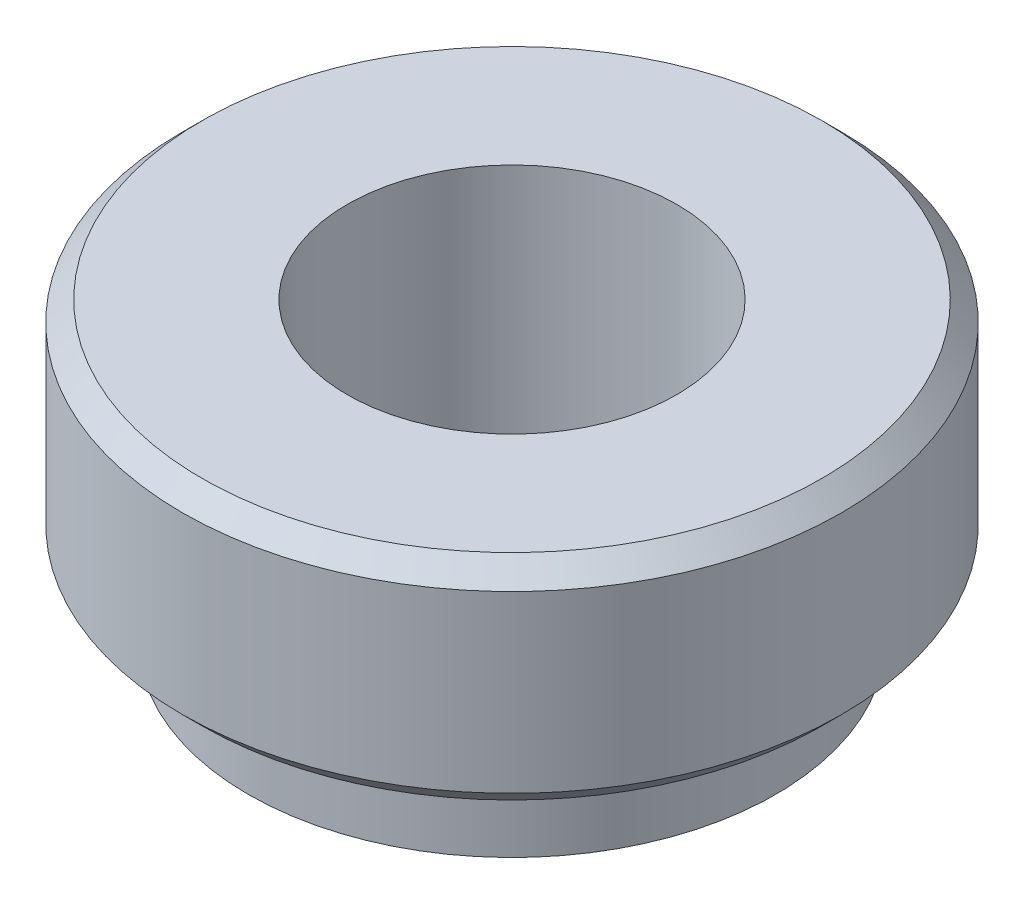
ISO-10303-21;
HEADER;
FILE_DESCRIPTION(('STEP AP214'),'2;1');
FILE_NAME('part.step','',(''),(''),'','','');
FILE_SCHEMA(('AUTOMOTIVE_DESIGN { 1 0 10303 214 1 1 1 1 }'));
ENDSEC;
DATA;
#1=APPLICATION_CONTEXT('core data for automotive mechanical design processes');
#2=APPLICATION_PROTOCOL_DEFINITION('international standard','automotive_design',2000,#1);
#3=PRODUCT_CONTEXT('',#1,'mechanical');
#4=PRODUCT('Part','Part','',(#3));
#5=PRODUCT_RELATED_PRODUCT_CATEGORY('part','',(#4));
#6=PRODUCT_DEFINITION_FORMATION('','',#4);
#7=PRODUCT_DEFINITION_CONTEXT('part definition',#1,'design');
#8=PRODUCT_DEFINITION('design','',#6,#7);
#9=PRODUCT_DEFINITION_SHAPE('','',#8);
#10=(LENGTH_UNIT() NAMED_UNIT(*) SI_UNIT(.MILLI.,.METRE.));
#11=(NAMED_UNIT(*) PLANE_ANGLE_UNIT() SI_UNIT($,.RADIAN.));
#12=(NAMED_UNIT(*) SI_UNIT($,.STERADIAN.) SOLID_ANGLE_UNIT());
#13=UNCERTAINTY_MEASURE_WITH_UNIT(LENGTH_MEASURE(1.E-05),#10,'distance_accuracy_value','');
#14=(GEOMETRIC_REPRESENTATION_CONTEXT(3) GLOBAL_UNCERTAINTY_ASSIGNED_CONTEXT((#13)) GLOBAL_UNIT_ASSIGNED_CONTEXT((#10,
#11,#12)) REPRESENTATION_CONTEXT('',''));
#15=CARTESIAN_POINT('',(0.,0.,0.));
#16=DIRECTION('',(0.,0.,1.));
#17=DIRECTION('',(1.,0.,0.));
#18=AXIS2_PLACEMENT_3D('',#15,#16,#17);
#19=CARTESIAN_POINT('',(-4.00000000000002,0.,0.));
#20=DIRECTION('',(0.,0.999999999999999,0.));
#21=DIRECTION('',(0.,0.,1.));
#22=AXIS2_PLACEMENT_3D('',#19,#20,#21);
#23=PLANE('',#22);
#24=CARTESIAN_POINT('',(0.,0.,0.));
#25=DIRECTION('',(0.,-0.999999999999999,0.));
#26=DIRECTION('',(0.,0.,-1.));
#27=AXIS2_PLACEMENT_3D('',#24,#25,#26);
#28=CIRCLE('',#27,2.5);
#29=CARTESIAN_POINT('',(0.,0.,-2.5));
#30=VERTEX_POINT('',#29);
#31=EDGE_CURVE('E46',#30,#30,#28,.T.);
#32=ORIENTED_EDGE('',*,*,#31,.F.);
#33=EDGE_LOOP('',(#32));
#34=FACE_BOUND('',#33,.T.);
#35=CARTESIAN_POINT('',(0.,0.,0.));
#36=DIRECTION('',(0.,-0.999999999999999,0.));
#37=DIRECTION('',(0.,0.,-1.));
#38=AXIS2_PLACEMENT_3D('',#35,#36,#37);
#39=CIRCLE('',#38,4.);
#40=CARTESIAN_POINT('',(0.,0.,-4.));
#41=VERTEX_POINT('',#40);
#42=EDGE_CURVE('E55',#41,#41,#39,.T.);
#43=ORIENTED_EDGE('',*,*,#42,.T.);
#44=EDGE_LOOP('',(#43));
#45=FACE_BOUND('',#44,.T.);
#46=ADVANCED_FACE('F27',(#34,#45),#23,.F.);
#47=CARTESIAN_POINT('',(0.,0.,0.));
#48=DIRECTION('',(0.,-0.999999999999999,0.));
#49=DIRECTION('',(0.,0.,-1.));
#50=AXIS2_PLACEMENT_3D('',#47,#48,#49);
#51=CYLINDRICAL_SURFACE('',#50,2.5);
#52=CARTESIAN_POINT('',(0.,4.49999999999984,0.));
#53=DIRECTION('',(0.,-0.999999999999999,0.));
#54=DIRECTION('',(0.,0.,-1.));
#55=AXIS2_PLACEMENT_3D('',#52,#53,#54);
#56=CIRCLE('',#55,2.5);
#57=CARTESIAN_POINT('',(0.,4.49999999999984,-2.49999999999998));
#58=VERTEX_POINT('',#57);
#59=EDGE_CURVE('E49',#58,#58,#56,.T.);
#60=ORIENTED_EDGE('',*,*,#59,.F.);
#61=EDGE_LOOP('',(#60));
#62=FACE_BOUND('',#61,.T.);
#63=ORIENTED_EDGE('',*,*,#31,.T.);
#64=EDGE_LOOP('',(#63));
#65=FACE_BOUND('',#64,.T.);
#66=ADVANCED_FACE('F78',(#62,#65),#51,.F.);
#67=CARTESIAN_POINT('',(-2.49999999999999,4.49999999999978,0.));
#68=DIRECTION('',(0.,-0.999999999999999,0.));
#69=DIRECTION('',(0.,0.,-1.));
#70=AXIS2_PLACEMENT_3D('',#67,#68,#69);
#71=PLANE('',#70);
#72=CARTESIAN_POINT('',(0.,4.49999999999984,0.));
#73=DIRECTION('',(0.,-0.999999999999999,0.));
#74=DIRECTION('',(0.,0.,-1.));
#75=AXIS2_PLACEMENT_3D('',#72,#73,#74);
#76=CIRCLE('',#75,4.7);
#77=CARTESIAN_POINT('',(0.,4.49999999999984,-4.69999999999999));
#78=VERTEX_POINT('',#77);
#79=EDGE_CURVE('E10',#78,#78,#76,.F.);
#80=ORIENTED_EDGE('',*,*,#79,.T.);
#81=EDGE_LOOP('',(#80));
#82=FACE_BOUND('',#81,.T.);
#83=ORIENTED_EDGE('',*,*,#59,.T.);
#84=EDGE_LOOP('',(#83));
#85=FACE_BOUND('',#84,.T.);
#86=ADVANCED_FACE('F75',(#82,#85),#71,.F.);
#87=CARTESIAN_POINT('',(0.,0.,0.));
#88=DIRECTION('',(0.,-0.999999999999999,0.));
#89=DIRECTION('',(0.,0.,-1.));
#90=AXIS2_PLACEMENT_3D('',#87,#88,#89);
#91=CYLINDRICAL_SURFACE('',#90,5.);
#92=CARTESIAN_POINT('',(0.,1.55000000000011,0.));
#93=DIRECTION('',(0.,0.999999999999999,0.));
#94=DIRECTION('',(0.,0.,1.));
#95=AXIS2_PLACEMENT_3D('',#92,#93,#94);
#96=CIRCLE('',#95,5.);
#97=CARTESIAN_POINT('',(0.,1.55000000000011,5.00000000000002));
#98=VERTEX_POINT('',#97);
#99=EDGE_CURVE('E33',#98,#98,#96,.T.);
#100=ORIENTED_EDGE('',*,*,#99,.T.);
#101=EDGE_LOOP('',(#100));
#102=FACE_BOUND('',#101,.T.);
#103=CARTESIAN_POINT('',(0.,4.19999999999987,0.));
#104=DIRECTION('',(0.,-0.999999999999999,0.));
#105=DIRECTION('',(0.,0.,-1.));
#106=AXIS2_PLACEMENT_3D('',#103,#104,#105);
#107=CIRCLE('',#106,5.);
#108=CARTESIAN_POINT('',(0.,4.19999999999987,-4.99999999999999));
#109=VERTEX_POINT('',#108);
#110=EDGE_CURVE('E37',#109,#109,#107,.T.);
#111=ORIENTED_EDGE('',*,*,#110,.T.);
#112=EDGE_LOOP('',(#111));
#113=FACE_BOUND('',#112,.T.);
#114=ADVANCED_FACE('F69',(#102,#113),#91,.T.);
#115=CARTESIAN_POINT('',(-5.00000000000001,1.25000000000003,0.));
#116=DIRECTION('',(0.,0.999999999999999,0.));
#117=DIRECTION('',(0.,0.,1.));
#118=AXIS2_PLACEMENT_3D('',#115,#116,#117);
#119=PLANE('',#118);
#120=CARTESIAN_POINT('',(0.,1.25000000000031,0.));
#121=DIRECTION('',(0.,0.999999999999999,0.));
#122=DIRECTION('',(0.,0.,1.));
#123=AXIS2_PLACEMENT_3D('',#120,#121,#122);
#124=CIRCLE('',#123,4.7);
#125=CARTESIAN_POINT('',(0.,1.25000000000031,4.70000000000002));
#126=VERTEX_POINT('',#125);
#127=EDGE_CURVE('E41',#126,#126,#124,.F.);
#128=ORIENTED_EDGE('',*,*,#127,.T.);
#129=EDGE_LOOP('',(#128));
#130=FACE_BOUND('',#129,.T.);
#131=CARTESIAN_POINT('',(0.,1.25000000000031,0.));
#132=DIRECTION('',(0.,-0.999999999999999,0.));
#133=DIRECTION('',(0.,0.,-1.));
#134=AXIS2_PLACEMENT_3D('',#131,#132,#133);
#135=CIRCLE('',#134,4.);
#136=CARTESIAN_POINT('',(0.,1.25000000000031,-3.99999999999998));
#137=VERTEX_POINT('',#136);
#138=EDGE_CURVE('E52',#137,#137,#135,.T.);
#139=ORIENTED_EDGE('',*,*,#138,.F.);
#140=EDGE_LOOP('',(#139));
#141=FACE_BOUND('',#140,.T.);
#142=ADVANCED_FACE('F64',(#130,#141),#119,.F.);
#143=CARTESIAN_POINT('',(0.,0.,0.));
#144=DIRECTION('',(0.,-0.999999999999999,0.));
#145=DIRECTION('',(0.,0.,-1.));
#146=AXIS2_PLACEMENT_3D('',#143,#144,#145);
#147=CYLINDRICAL_SURFACE('',#146,4.);
#148=ORIENTED_EDGE('',*,*,#42,.F.);
#149=EDGE_LOOP('',(#148));
#150=FACE_BOUND('',#149,.T.);
#151=ORIENTED_EDGE('',*,*,#138,.T.);
#152=EDGE_LOOP('',(#151));
#153=FACE_BOUND('',#152,.T.);
#154=ADVANCED_FACE('F60',(#150,#153),#147,.T.);
#155=CARTESIAN_POINT('',(0.,1.25000000000031,0.));
#156=DIRECTION('',(0.,0.999999999999999,0.));
#157=DIRECTION('',(0.,0.,1.));
#158=AXIS2_PLACEMENT_3D('',#155,#156,#157);
#159=CONICAL_SURFACE('',#158,4.7,0.785398163397448);
#160=ORIENTED_EDGE('',*,*,#99,.F.);
#161=EDGE_LOOP('',(#160));
#162=FACE_BOUND('',#161,.T.);
#163=ORIENTED_EDGE('',*,*,#127,.F.);
#164=EDGE_LOOP('',(#163));
#165=FACE_BOUND('',#164,.T.);
#166=ADVANCED_FACE('F63',(#162,#165),#159,.T.);
#167=CARTESIAN_POINT('',(0.,4.19999999999987,0.));
#168=DIRECTION('',(0.,-0.999999999999999,0.));
#169=DIRECTION('',(0.,0.,-1.));
#170=AXIS2_PLACEMENT_3D('',#167,#168,#169);
#171=CONICAL_SURFACE('',#170,5.,0.785398163397447);
#172=ORIENTED_EDGE('',*,*,#79,.F.);
#173=EDGE_LOOP('',(#172));
#174=FACE_BOUND('',#173,.T.);
#175=ORIENTED_EDGE('',*,*,#110,.F.);
#176=EDGE_LOOP('',(#175));
#177=FACE_BOUND('',#176,.T.);
#178=ADVANCED_FACE('F99',(#174,#177),#171,.T.);
#179=CLOSED_SHELL('',(#46,#66,#86,#114,#142,#154,#166,#178));
#180=MANIFOLD_SOLID_BREP('B2',#179);
#181=ADVANCED_BREP_SHAPE_REPRESENTATION('',(#18,#180),#14);
#182=SHAPE_DEFINITION_REPRESENTATION(#9,#181);
ENDSEC;
END-ISO-10303-21;
